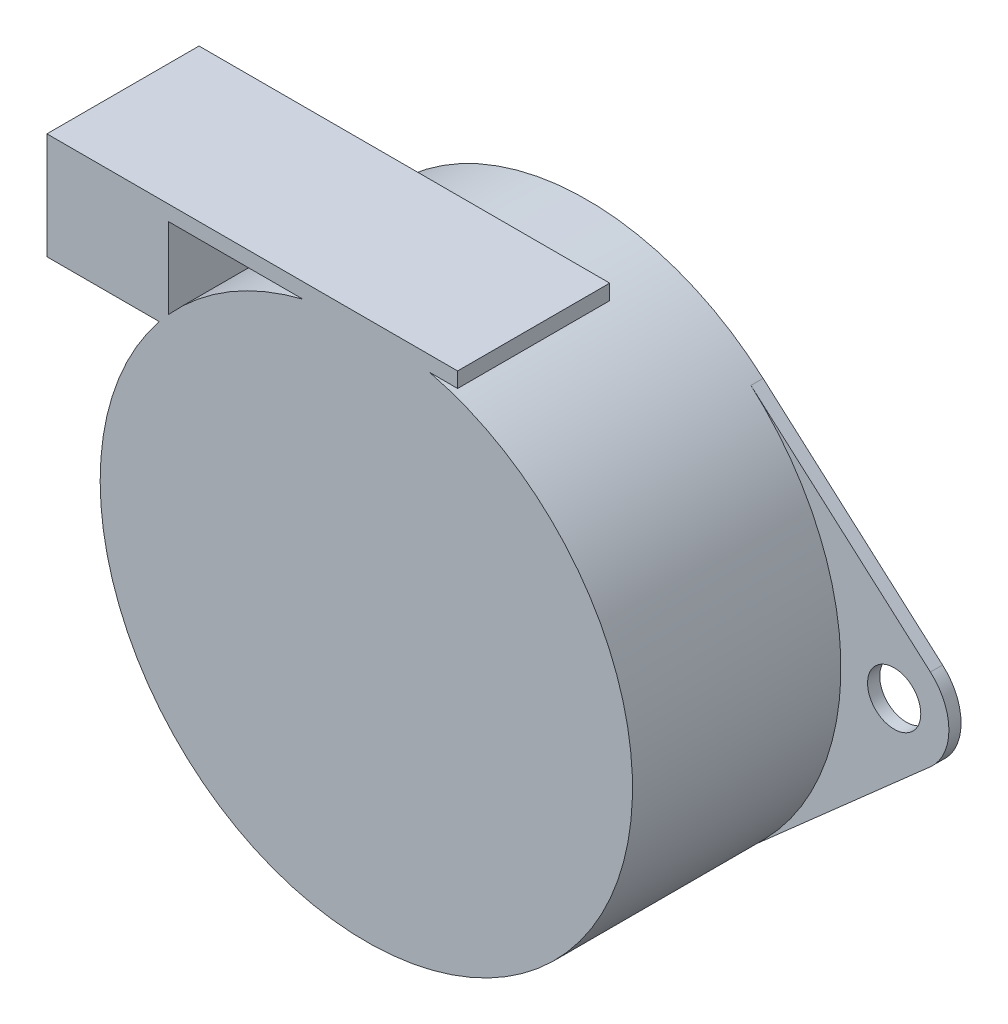
ISO-10303-21;
HEADER;
FILE_DESCRIPTION(('STEP AP214'),'2;1');
FILE_NAME('part.step','',(''),(''),'','','');
FILE_SCHEMA(('AUTOMOTIVE_DESIGN { 1 0 10303 214 1 1 1 1 }'));
ENDSEC;
DATA;
#1=APPLICATION_CONTEXT('core data for automotive mechanical design processes');
#2=APPLICATION_PROTOCOL_DEFINITION('international standard','automotive_design',2000,#1);
#3=PRODUCT_CONTEXT('',#1,'mechanical');
#4=PRODUCT('Part','Part','',(#3));
#5=PRODUCT_RELATED_PRODUCT_CATEGORY('part','',(#4));
#6=PRODUCT_DEFINITION_FORMATION('','',#4);
#7=PRODUCT_DEFINITION_CONTEXT('part definition',#1,'design');
#8=PRODUCT_DEFINITION('design','',#6,#7);
#9=PRODUCT_DEFINITION_SHAPE('','',#8);
#10=(LENGTH_UNIT() NAMED_UNIT(*) SI_UNIT(.MILLI.,.METRE.));
#11=(NAMED_UNIT(*) PLANE_ANGLE_UNIT() SI_UNIT($,.RADIAN.));
#12=(NAMED_UNIT(*) SI_UNIT($,.STERADIAN.) SOLID_ANGLE_UNIT());
#13=UNCERTAINTY_MEASURE_WITH_UNIT(LENGTH_MEASURE(1.E-05),#10,'distance_accuracy_value','');
#14=(GEOMETRIC_REPRESENTATION_CONTEXT(3) GLOBAL_UNCERTAINTY_ASSIGNED_CONTEXT((#13)) GLOBAL_UNIT_ASSIGNED_CONTEXT((#10,
#11,#12)) REPRESENTATION_CONTEXT('',''));
#15=CARTESIAN_POINT('',(0.,0.,0.));
#16=DIRECTION('',(0.,0.,1.));
#17=DIRECTION('',(1.,0.,0.));
#18=AXIS2_PLACEMENT_3D('',#15,#16,#17);
#19=CARTESIAN_POINT('',(0.,0.,0.8));
#20=DIRECTION('',(0.,0.,-1.));
#21=DIRECTION('',(-1.,0.,0.));
#22=AXIS2_PLACEMENT_3D('',#19,#20,#21);
#23=CYLINDRICAL_SURFACE('',#22,17.4999999999699);
#24=CARTESIAN_POINT('',(0.,0.,0.));
#25=DIRECTION('',(0.,0.,1.));
#26=DIRECTION('',(1.,0.,0.));
#27=AXIS2_PLACEMENT_3D('',#24,#25,#26);
#28=CIRCLE('',#27,17.4999999999699);
#29=CARTESIAN_POINT('',(-11.5833333333093,-13.1177890243894,0.));
#30=VERTEX_POINT('',#29);
#31=CARTESIAN_POINT('',(11.5833333333093,-13.1177890243894,0.));
#32=VERTEX_POINT('',#31);
#33=EDGE_CURVE('E268',#30,#32,#28,.T.);
#34=ORIENTED_EDGE('',*,*,#33,.T.);
#35=DIRECTION('',(0.,0.,-1.));
#36=VECTOR('',#35,1.);
#37=CARTESIAN_POINT('',(11.5833333333093,-13.1177890243894,0.8));
#38=LINE('',#37,#36);
#39=CARTESIAN_POINT('',(11.5833333333093,-13.1177890243894,0.8));
#40=VERTEX_POINT('',#39);
#41=EDGE_CURVE('E280',#40,#32,#38,.T.);
#42=ORIENTED_EDGE('',*,*,#41,.F.);
#43=CARTESIAN_POINT('',(0.,0.,0.8));
#44=DIRECTION('',(0.,0.,1.));
#45=DIRECTION('',(1.,0.,0.));
#46=AXIS2_PLACEMENT_3D('',#43,#44,#45);
#47=CIRCLE('',#46,17.4999999999983);
#48=CARTESIAN_POINT('',(11.5833333333336,13.1177890244058,0.8));
#49=VERTEX_POINT('',#48);
#50=EDGE_CURVE('E291',#40,#49,#47,.T.);
#51=ORIENTED_EDGE('',*,*,#50,.T.);
#52=DIRECTION('',(0.,0.,-1.));
#53=VECTOR('',#52,1.);
#54=CARTESIAN_POINT('',(11.5833333333281,13.1177890244107,0.8));
#55=LINE('',#54,#53);
#56=CARTESIAN_POINT('',(11.5833333333281,13.1177890244107,0.));
#57=VERTEX_POINT('',#56);
#58=EDGE_CURVE('E292',#49,#57,#55,.T.);
#59=ORIENTED_EDGE('',*,*,#58,.T.);
#60=CARTESIAN_POINT('',(0.,0.,0.));
#61=DIRECTION('',(0.,0.,1.));
#62=DIRECTION('',(1.,0.,0.));
#63=AXIS2_PLACEMENT_3D('',#60,#61,#62);
#64=CIRCLE('',#63,17.4999999999983);
#65=CARTESIAN_POINT('',(-11.5833333333281,13.1177890244107,0.));
#66=VERTEX_POINT('',#65);
#67=EDGE_CURVE('E259',#66,#57,#64,.F.);
#68=ORIENTED_EDGE('',*,*,#67,.F.);
#69=DIRECTION('',(0.,0.,-1.));
#70=VECTOR('',#69,1.);
#71=CARTESIAN_POINT('',(-11.5833333333281,13.1177890244107,0.8));
#72=LINE('',#71,#70);
#73=CARTESIAN_POINT('',(-11.5833333333281,13.1177890244107,0.8));
#74=VERTEX_POINT('',#73);
#75=EDGE_CURVE('E288',#74,#66,#72,.T.);
#76=ORIENTED_EDGE('',*,*,#75,.F.);
#77=CARTESIAN_POINT('',(-11.5833333333093,-13.1177890243894,0.8));
#78=VERTEX_POINT('',#77);
#79=EDGE_CURVE('E298',#74,#78,#47,.T.);
#80=ORIENTED_EDGE('',*,*,#79,.T.);
#81=DIRECTION('',(0.,0.,-1.));
#82=VECTOR('',#81,1.);
#83=CARTESIAN_POINT('',(-11.5833333333093,-13.1177890243894,0.8));
#84=LINE('',#83,#82);
#85=EDGE_CURVE('E285',#78,#30,#84,.T.);
#86=ORIENTED_EDGE('',*,*,#85,.T.);
#87=EDGE_LOOP('',(#34,#42,#51,#59,#68,#76,#80,#86));
#88=FACE_BOUND('',#87,.T.);
#89=DIRECTION('',(0.,0.,-1.));
#90=VECTOR('',#89,1.);
#91=CARTESIAN_POINT('',(4.1533119313391,16.9999999999983,0.8));
#92=LINE('',#91,#90);
#93=CARTESIAN_POINT('',(4.15331193145884,16.9999999999983,14.5));
#94=VERTEX_POINT('',#93);
#95=CARTESIAN_POINT('',(4.1533119313391,16.9999999999983,4.50000000000364));
#96=VERTEX_POINT('',#95);
#97=EDGE_CURVE('E201',#94,#96,#92,.T.);
#98=ORIENTED_EDGE('',*,*,#97,.F.);
#99=CARTESIAN_POINT('',(0.,0.,14.5));
#100=DIRECTION('',(0.,0.,1.));
#101=DIRECTION('',(1.,0.,0.));
#102=AXIS2_PLACEMENT_3D('',#99,#100,#101);
#103=CIRCLE('',#102,17.4999999999983);
#104=CARTESIAN_POINT('',(-13.6106575888154,10.9999999999983,14.4999999999991));
#105=VERTEX_POINT('',#104);
#106=EDGE_CURVE('E234',#105,#94,#103,.T.);
#107=ORIENTED_EDGE('',*,*,#106,.F.);
#108=DIRECTION('',(0.,0.,-1.));
#109=VECTOR('',#108,1.);
#110=CARTESIAN_POINT('',(-13.6106575887788,10.9999999999983,0.8));
#111=LINE('',#110,#109);
#112=CARTESIAN_POINT('',(-13.6106575887788,10.9999999999983,4.50000000000364));
#113=VERTEX_POINT('',#112);
#114=EDGE_CURVE('E218',#113,#105,#111,.F.);
#115=ORIENTED_EDGE('',*,*,#114,.F.);
#116=CARTESIAN_POINT('',(0.,0.,4.50000000000364));
#117=DIRECTION('',(0.,0.,1.));
#118=DIRECTION('',(1.,0.,0.));
#119=AXIS2_PLACEMENT_3D('',#116,#117,#118);
#120=CIRCLE('',#119,17.4999999999699);
#121=CARTESIAN_POINT('',(-12.9999999999933,11.7153745138224,4.50000000000364));
#122=VERTEX_POINT('',#121);
#123=EDGE_CURVE('E11',#122,#113,#120,.T.);
#124=ORIENTED_EDGE('',*,*,#123,.F.);
#125=DIRECTION('',(0.,0.,-1.));
#126=VECTOR('',#125,1.);
#127=CARTESIAN_POINT('',(-12.9999999999933,11.7153745138224,0.8));
#128=LINE('',#127,#126);
#129=CARTESIAN_POINT('',(-12.9999999999933,11.7153745138649,14.5));
#130=VERTEX_POINT('',#129);
#131=EDGE_CURVE('E221',#130,#122,#128,.T.);
#132=ORIENTED_EDGE('',*,*,#131,.F.);
#133=CARTESIAN_POINT('',(-4.15331193145884,16.9999999999983,14.4999999999991));
#134=VERTEX_POINT('',#133);
#135=EDGE_CURVE('E233',#134,#130,#103,.T.);
#136=ORIENTED_EDGE('',*,*,#135,.F.);
#137=DIRECTION('',(0.,0.,-1.));
#138=VECTOR('',#137,1.);
#139=CARTESIAN_POINT('',(-4.1533119313391,16.9999999999983,0.8));
#140=LINE('',#139,#138);
#141=CARTESIAN_POINT('',(-4.1533119313391,16.9999999999983,4.50000000000364));
#142=VERTEX_POINT('',#141);
#143=EDGE_CURVE('E56',#142,#134,#140,.F.);
#144=ORIENTED_EDGE('',*,*,#143,.F.);
#145=CARTESIAN_POINT('',(0.,0.,4.50000000000364));
#146=DIRECTION('',(0.,0.,-1.));
#147=DIRECTION('',(-1.,0.,0.));
#148=AXIS2_PLACEMENT_3D('',#145,#146,#147);
#149=CIRCLE('',#148,17.4999999999699);
#150=EDGE_CURVE('E51',#142,#96,#149,.T.);
#151=ORIENTED_EDGE('',*,*,#150,.T.);
#152=EDGE_LOOP('',(#98,#107,#115,#124,#132,#136,#144,#151));
#153=FACE_BOUND('',#152,.T.);
#154=ADVANCED_FACE('F36',(#88,#153),#23,.T.);
#155=CARTESIAN_POINT('',(0.,0.,0.8));
#156=DIRECTION('',(0.,0.,1.));
#157=DIRECTION('',(1.,0.,0.));
#158=AXIS2_PLACEMENT_3D('',#155,#156,#157);
#159=PLANE('',#158);
#160=ORIENTED_EDGE('',*,*,#79,.F.);
#161=DIRECTION('',(-0.749587944251835,-0.661904761904844,0.));
#162=VECTOR('',#161,1.);
#163=CARTESIAN_POINT('',(-11.5833333333336,13.1177890244058,0.8));
#164=LINE('',#163,#162);
#165=CARTESIAN_POINT('',(-23.3828571428582,2.69851659930132,0.8));
#166=VERTEX_POINT('',#165);
#167=EDGE_CURVE('E245',#74,#166,#164,.T.);
#168=ORIENTED_EDGE('',*,*,#167,.T.);
#169=CARTESIAN_POINT('',(-21.0000000000075,0.,0.8));
#170=DIRECTION('',(0.,0.,1.));
#171=DIRECTION('',(1.,0.,0.));
#172=AXIS2_PLACEMENT_3D('',#169,#170,#171);
#173=CIRCLE('',#172,3.5999999999774);
#174=CARTESIAN_POINT('',(-23.3828571428394,-2.69851659928003,0.8));
#175=VERTEX_POINT('',#174);
#176=EDGE_CURVE('E242',#166,#175,#173,.T.);
#177=ORIENTED_EDGE('',*,*,#176,.T.);
#178=DIRECTION('',(0.749587944251835,-0.661904761904844,0.));
#179=VECTOR('',#178,1.);
#180=CARTESIAN_POINT('',(-11.5833333333148,-13.1177890243845,0.8));
#181=LINE('',#180,#179);
#182=EDGE_CURVE('E244',#175,#78,#181,.T.);
#183=ORIENTED_EDGE('',*,*,#182,.T.);
#184=EDGE_LOOP('',(#160,#168,#177,#183));
#185=FACE_BOUND('',#184,.T.);
#186=CARTESIAN_POINT('',(-21.0000000000075,0.,0.8));
#187=DIRECTION('',(0.,0.,1.));
#188=DIRECTION('',(1.,0.,0.));
#189=AXIS2_PLACEMENT_3D('',#186,#187,#188);
#190=CIRCLE('',#189,1.75);
#191=CARTESIAN_POINT('',(-19.2500000000075,0.,0.8));
#192=VERTEX_POINT('',#191);
#193=EDGE_CURVE('E246',#192,#192,#190,.T.);
#194=ORIENTED_EDGE('',*,*,#193,.F.);
#195=EDGE_LOOP('',(#194));
#196=FACE_BOUND('',#195,.T.);
#197=ADVANCED_FACE('F338',(#185,#196),#159,.T.);
#198=CARTESIAN_POINT('',(21.0000000000075,0.,0.8));
#199=DIRECTION('',(0.,0.,-1.));
#200=DIRECTION('',(-1.,0.,0.));
#201=AXIS2_PLACEMENT_3D('',#198,#199,#200);
#202=CYLINDRICAL_SURFACE('',#201,3.5999999999774);
#203=CARTESIAN_POINT('',(21.0000000000075,0.,0.));
#204=DIRECTION('',(0.,0.,1.));
#205=DIRECTION('',(1.,0.,0.));
#206=AXIS2_PLACEMENT_3D('',#203,#204,#205);
#207=CIRCLE('',#206,3.5999999999774);
#208=CARTESIAN_POINT('',(23.3828571428582,2.69851659930132,0.));
#209=VERTEX_POINT('',#208);
#210=CARTESIAN_POINT('',(23.3828571428394,-2.69851659928003,0.));
#211=VERTEX_POINT('',#210);
#212=EDGE_CURVE('E236',#209,#211,#207,.F.);
#213=ORIENTED_EDGE('',*,*,#212,.F.);
#214=DIRECTION('',(0.,0.,-1.));
#215=VECTOR('',#214,1.);
#216=CARTESIAN_POINT('',(23.3828571428582,2.69851659930132,0.8));
#217=LINE('',#216,#215);
#218=CARTESIAN_POINT('',(23.3828571428582,2.69851659930132,0.8));
#219=VERTEX_POINT('',#218);
#220=EDGE_CURVE('E289',#219,#209,#217,.T.);
#221=ORIENTED_EDGE('',*,*,#220,.F.);
#222=CARTESIAN_POINT('',(21.0000000000075,0.,0.8));
#223=DIRECTION('',(0.,0.,1.));
#224=DIRECTION('',(1.,0.,0.));
#225=AXIS2_PLACEMENT_3D('',#222,#223,#224);
#226=CIRCLE('',#225,3.5999999999774);
#227=CARTESIAN_POINT('',(23.3828571428394,-2.69851659928003,0.8));
#228=VERTEX_POINT('',#227);
#229=EDGE_CURVE('E237',#219,#228,#226,.F.);
#230=ORIENTED_EDGE('',*,*,#229,.T.);
#231=DIRECTION('',(0.,0.,-1.));
#232=VECTOR('',#231,1.);
#233=CARTESIAN_POINT('',(23.3828571428394,-2.69851659928003,0.8));
#234=LINE('',#233,#232);
#235=EDGE_CURVE('E253',#228,#211,#234,.T.);
#236=ORIENTED_EDGE('',*,*,#235,.T.);
#237=EDGE_LOOP('',(#213,#221,#230,#236));
#238=FACE_BOUND('',#237,.T.);
#239=ADVANCED_FACE('F38',(#238),#202,.T.);
#240=CARTESIAN_POINT('',(11.5833333333336,13.1177890244058,0.8));
#241=DIRECTION('',(0.661904761904844,0.749587944251835,0.));
#242=DIRECTION('',(-0.749587944251835,0.661904761904844,0.));
#243=AXIS2_PLACEMENT_3D('',#240,#241,#242);
#244=PLANE('',#243);
#245=DIRECTION('',(0.749587944251835,-0.661904761904844,0.));
#246=VECTOR('',#245,1.);
#247=CARTESIAN_POINT('',(11.5833333333336,13.1177890244058,0.));
#248=LINE('',#247,#246);
#249=EDGE_CURVE('E256',#57,#209,#248,.T.);
#250=ORIENTED_EDGE('',*,*,#249,.F.);
#251=ORIENTED_EDGE('',*,*,#58,.F.);
#252=DIRECTION('',(0.749587944251835,-0.661904761904844,0.));
#253=VECTOR('',#252,1.);
#254=CARTESIAN_POINT('',(11.5833333333336,13.1177890244058,0.8));
#255=LINE('',#254,#253);
#256=EDGE_CURVE('E240',#49,#219,#255,.T.);
#257=ORIENTED_EDGE('',*,*,#256,.T.);
#258=ORIENTED_EDGE('',*,*,#220,.T.);
#259=EDGE_LOOP('',(#250,#251,#257,#258));
#260=FACE_BOUND('',#259,.T.);
#261=ADVANCED_FACE('F368',(#260),#244,.T.);
#262=CARTESIAN_POINT('',(-11.5833333333336,13.1177890244058,0.8));
#263=DIRECTION('',(0.661904761904844,-0.749587944251835,0.));
#264=DIRECTION('',(0.749587944251835,0.661904761904844,0.));
#265=AXIS2_PLACEMENT_3D('',#262,#263,#264);
#266=PLANE('',#265);
#267=DIRECTION('',(-0.749587944251835,-0.661904761904844,0.));
#268=VECTOR('',#267,1.);
#269=CARTESIAN_POINT('',(-11.5833333333336,13.1177890244058,0.));
#270=LINE('',#269,#268);
#271=CARTESIAN_POINT('',(-23.3828571428582,2.69851659930132,0.));
#272=VERTEX_POINT('',#271);
#273=EDGE_CURVE('E262',#66,#272,#270,.T.);
#274=ORIENTED_EDGE('',*,*,#273,.T.);
#275=DIRECTION('',(0.,0.,-1.));
#276=VECTOR('',#275,1.);
#277=CARTESIAN_POINT('',(-23.3828571428582,2.69851659930132,0.8));
#278=LINE('',#277,#276);
#279=EDGE_CURVE('E284',#166,#272,#278,.T.);
#280=ORIENTED_EDGE('',*,*,#279,.F.);
#281=ORIENTED_EDGE('',*,*,#167,.F.);
#282=ORIENTED_EDGE('',*,*,#75,.T.);
#283=EDGE_LOOP('',(#274,#280,#281,#282));
#284=FACE_BOUND('',#283,.T.);
#285=ADVANCED_FACE('F344',(#284),#266,.F.);
#286=CARTESIAN_POINT('',(-21.0000000000075,0.,0.8));
#287=DIRECTION('',(0.,0.,-1.));
#288=DIRECTION('',(-1.,0.,0.));
#289=AXIS2_PLACEMENT_3D('',#286,#287,#288);
#290=CYLINDRICAL_SURFACE('',#289,3.5999999999774);
#291=CARTESIAN_POINT('',(-21.0000000000075,0.,0.));
#292=DIRECTION('',(0.,0.,1.));
#293=DIRECTION('',(1.,0.,0.));
#294=AXIS2_PLACEMENT_3D('',#291,#292,#293);
#295=CIRCLE('',#294,3.5999999999774);
#296=CARTESIAN_POINT('',(-23.3828571428394,-2.69851659928003,0.));
#297=VERTEX_POINT('',#296);
#298=EDGE_CURVE('E264',#272,#297,#295,.T.);
#299=ORIENTED_EDGE('',*,*,#298,.T.);
#300=DIRECTION('',(0.,0.,-1.));
#301=VECTOR('',#300,1.);
#302=CARTESIAN_POINT('',(-23.3828571428394,-2.69851659928003,0.8));
#303=LINE('',#302,#301);
#304=EDGE_CURVE('E281',#175,#297,#303,.T.);
#305=ORIENTED_EDGE('',*,*,#304,.F.);
#306=ORIENTED_EDGE('',*,*,#176,.F.);
#307=ORIENTED_EDGE('',*,*,#279,.T.);
#308=EDGE_LOOP('',(#299,#305,#306,#307));
#309=FACE_BOUND('',#308,.T.);
#310=ADVANCED_FACE('F348',(#309),#290,.T.);
#311=CARTESIAN_POINT('',(-11.5833333333148,-13.1177890243845,0.8));
#312=DIRECTION('',(0.661904761904844,0.749587944251835,0.));
#313=DIRECTION('',(-0.749587944251835,0.661904761904844,0.));
#314=AXIS2_PLACEMENT_3D('',#311,#312,#313);
#315=PLANE('',#314);
#316=DIRECTION('',(0.749587944251835,-0.661904761904844,0.));
#317=VECTOR('',#316,1.);
#318=CARTESIAN_POINT('',(-11.5833333333148,-13.1177890243845,0.));
#319=LINE('',#318,#317);
#320=EDGE_CURVE('E266',#297,#30,#319,.T.);
#321=ORIENTED_EDGE('',*,*,#320,.T.);
#322=ORIENTED_EDGE('',*,*,#85,.F.);
#323=ORIENTED_EDGE('',*,*,#182,.F.);
#324=ORIENTED_EDGE('',*,*,#304,.T.);
#325=EDGE_LOOP('',(#321,#322,#323,#324));
#326=FACE_BOUND('',#325,.T.);
#327=ADVANCED_FACE('F351',(#326),#315,.F.);
#328=CARTESIAN_POINT('',(-21.0000000000075,0.,0.8));
#329=DIRECTION('',(0.,0.,-1.));
#330=DIRECTION('',(-1.,0.,0.));
#331=AXIS2_PLACEMENT_3D('',#328,#329,#330);
#332=CYLINDRICAL_SURFACE('',#331,1.75);
#333=ORIENTED_EDGE('',*,*,#193,.T.);
#334=EDGE_LOOP('',(#333));
#335=FACE_BOUND('',#334,.T.);
#336=CARTESIAN_POINT('',(-21.0000000000075,0.,0.));
#337=DIRECTION('',(0.,0.,1.));
#338=DIRECTION('',(1.,0.,0.));
#339=AXIS2_PLACEMENT_3D('',#336,#337,#338);
#340=CIRCLE('',#339,1.75);
#341=CARTESIAN_POINT('',(-19.2500000000075,0.,0.));
#342=VERTEX_POINT('',#341);
#343=EDGE_CURVE('E274',#342,#342,#340,.T.);
#344=ORIENTED_EDGE('',*,*,#343,.F.);
#345=EDGE_LOOP('',(#344));
#346=FACE_BOUND('',#345,.T.);
#347=ADVANCED_FACE('F387',(#335,#346),#332,.F.);
#348=CARTESIAN_POINT('',(11.5833333333148,-13.1177890243845,0.8));
#349=DIRECTION('',(0.661904761904844,-0.749587944251835,0.));
#350=DIRECTION('',(0.749587944251835,0.661904761904844,0.));
#351=AXIS2_PLACEMENT_3D('',#348,#349,#350);
#352=PLANE('',#351);
#353=DIRECTION('',(-0.749587944251835,-0.661904761904844,0.));
#354=VECTOR('',#353,1.);
#355=CARTESIAN_POINT('',(11.5833333333148,-13.1177890243845,0.));
#356=LINE('',#355,#354);
#357=EDGE_CURVE('E271',#211,#32,#356,.T.);
#358=ORIENTED_EDGE('',*,*,#357,.F.);
#359=ORIENTED_EDGE('',*,*,#235,.F.);
#360=DIRECTION('',(-0.749587944251835,-0.661904761904844,0.));
#361=VECTOR('',#360,1.);
#362=CARTESIAN_POINT('',(11.5833333333148,-13.1177890243845,0.8));
#363=LINE('',#362,#361);
#364=EDGE_CURVE('E250',#228,#40,#363,.T.);
#365=ORIENTED_EDGE('',*,*,#364,.T.);
#366=ORIENTED_EDGE('',*,*,#41,.T.);
#367=EDGE_LOOP('',(#358,#359,#365,#366));
#368=FACE_BOUND('',#367,.T.);
#369=ADVANCED_FACE('F357',(#368),#352,.T.);
#370=CARTESIAN_POINT('',(21.0000000000075,0.,0.8));
#371=DIRECTION('',(0.,0.,-1.));
#372=DIRECTION('',(-1.,0.,0.));
#373=AXIS2_PLACEMENT_3D('',#370,#371,#372);
#374=CYLINDRICAL_SURFACE('',#373,1.75);
#375=CARTESIAN_POINT('',(21.0000000000075,0.,0.8));
#376=DIRECTION('',(0.,0.,1.));
#377=DIRECTION('',(1.,0.,0.));
#378=AXIS2_PLACEMENT_3D('',#375,#376,#377);
#379=CIRCLE('',#378,1.75);
#380=CARTESIAN_POINT('',(22.7500000000075,0.,0.8));
#381=VERTEX_POINT('',#380);
#382=EDGE_CURVE('E249',#381,#381,#379,.F.);
#383=ORIENTED_EDGE('',*,*,#382,.F.);
#384=EDGE_LOOP('',(#383));
#385=FACE_BOUND('',#384,.T.);
#386=CARTESIAN_POINT('',(21.0000000000075,0.,0.));
#387=DIRECTION('',(0.,0.,1.));
#388=DIRECTION('',(1.,0.,0.));
#389=AXIS2_PLACEMENT_3D('',#386,#387,#388);
#390=CIRCLE('',#389,1.75);
#391=CARTESIAN_POINT('',(22.7500000000075,0.,0.));
#392=VERTEX_POINT('',#391);
#393=EDGE_CURVE('E241',#392,#392,#390,.F.);
#394=ORIENTED_EDGE('',*,*,#393,.T.);
#395=EDGE_LOOP('',(#394));
#396=FACE_BOUND('',#395,.T.);
#397=ADVANCED_FACE('F411',(#385,#396),#374,.F.);
#398=ORIENTED_EDGE('',*,*,#50,.F.);
#399=ORIENTED_EDGE('',*,*,#364,.F.);
#400=ORIENTED_EDGE('',*,*,#229,.F.);
#401=ORIENTED_EDGE('',*,*,#256,.F.);
#402=EDGE_LOOP('',(#398,#399,#400,#401));
#403=FACE_BOUND('',#402,.T.);
#404=ORIENTED_EDGE('',*,*,#382,.T.);
#405=EDGE_LOOP('',(#404));
#406=FACE_BOUND('',#405,.T.);
#407=ADVANCED_FACE('F363',(#403,#406),#159,.T.);
#408=CARTESIAN_POINT('',(0.,0.,0.));
#409=DIRECTION('',(0.,0.,1.));
#410=DIRECTION('',(1.,0.,0.));
#411=AXIS2_PLACEMENT_3D('',#408,#409,#410);
#412=PLANE('',#411);
#413=CARTESIAN_POINT('',(0.,0.,0.));
#414=DIRECTION('',(0.,0.,1.));
#415=DIRECTION('',(1.,0.,0.));
#416=AXIS2_PLACEMENT_3D('',#413,#414,#415);
#417=CIRCLE('',#416,5.);
#418=CARTESIAN_POINT('',(5.,0.,0.));
#419=VERTEX_POINT('',#418);
#420=EDGE_CURVE('E44',#419,#419,#417,.F.);
#421=ORIENTED_EDGE('',*,*,#420,.F.);
#422=EDGE_LOOP('',(#421));
#423=FACE_BOUND('',#422,.T.);
#424=ORIENTED_EDGE('',*,*,#212,.T.);
#425=ORIENTED_EDGE('',*,*,#357,.T.);
#426=ORIENTED_EDGE('',*,*,#33,.F.);
#427=ORIENTED_EDGE('',*,*,#320,.F.);
#428=ORIENTED_EDGE('',*,*,#298,.F.);
#429=ORIENTED_EDGE('',*,*,#273,.F.);
#430=ORIENTED_EDGE('',*,*,#67,.T.);
#431=ORIENTED_EDGE('',*,*,#249,.T.);
#432=EDGE_LOOP('',(#424,#425,#426,#427,#428,#429,#430,#431));
#433=FACE_BOUND('',#432,.T.);
#434=ORIENTED_EDGE('',*,*,#343,.T.);
#435=EDGE_LOOP('',(#434));
#436=FACE_BOUND('',#435,.T.);
#437=ORIENTED_EDGE('',*,*,#393,.F.);
#438=EDGE_LOOP('',(#437));
#439=FACE_BOUND('',#438,.T.);
#440=ADVANCED_FACE('F353',(#423,#433,#436,#439),#412,.F.);
#441=CARTESIAN_POINT('',(0.,0.,14.5));
#442=DIRECTION('',(0.,0.,1.));
#443=DIRECTION('',(1.,0.,0.));
#444=AXIS2_PLACEMENT_3D('',#441,#442,#443);
#445=PLANE('',#444);
#446=DIRECTION('',(1.,0.,0.));
#447=VECTOR('',#446,1.);
#448=CARTESIAN_POINT('',(-20.9999999999933,16.9999999999983,14.4999999999991));
#449=LINE('',#448,#447);
#450=CARTESIAN_POINT('',(-12.9999999999933,16.9999999999983,14.4999999999991));
#451=VERTEX_POINT('',#450);
#452=EDGE_CURVE('E188',#451,#134,#449,.T.);
#453=ORIENTED_EDGE('',*,*,#452,.T.);
#454=ORIENTED_EDGE('',*,*,#135,.T.);
#455=DIRECTION('',(0.,1.,0.));
#456=VECTOR('',#455,1.);
#457=CARTESIAN_POINT('',(-12.9999999999933,10.9999999999983,14.4999999999991));
#458=LINE('',#457,#456);
#459=EDGE_CURVE('E164',#130,#451,#458,.T.);
#460=ORIENTED_EDGE('',*,*,#459,.T.);
#461=EDGE_LOOP('',(#453,#454,#460));
#462=FACE_BOUND('',#461,.T.);
#463=ORIENTED_EDGE('',*,*,#106,.T.);
#464=CARTESIAN_POINT('',(6.00000000000012,16.9999999999983,14.4999999999991));
#465=VERTEX_POINT('',#464);
#466=EDGE_CURVE('E186',#94,#465,#449,.T.);
#467=ORIENTED_EDGE('',*,*,#466,.T.);
#468=DIRECTION('',(0.,1.,0.));
#469=VECTOR('',#468,1.);
#470=CARTESIAN_POINT('',(6.00000000000012,16.9999999999983,14.4999999999991));
#471=LINE('',#470,#469);
#472=CARTESIAN_POINT('',(6.00000000000012,17.9999999999983,14.4999999999991));
#473=VERTEX_POINT('',#472);
#474=EDGE_CURVE('E172',#465,#473,#471,.T.);
#475=ORIENTED_EDGE('',*,*,#474,.T.);
#476=DIRECTION('',(1.,0.,0.));
#477=VECTOR('',#476,1.);
#478=CARTESIAN_POINT('',(-20.9999999999933,17.9999999999983,14.4999999999991));
#479=LINE('',#478,#477);
#480=CARTESIAN_POINT('',(-20.9999999999933,17.9999999999983,14.4999999999991));
#481=VERTEX_POINT('',#480);
#482=EDGE_CURVE('E168',#481,#473,#479,.T.);
#483=ORIENTED_EDGE('',*,*,#482,.F.);
#484=DIRECTION('',(0.,1.,0.));
#485=VECTOR('',#484,1.);
#486=CARTESIAN_POINT('',(-20.9999999999933,10.9999999999983,14.4999999999991));
#487=LINE('',#486,#485);
#488=CARTESIAN_POINT('',(-20.9999999999933,10.9999999999983,14.4999999999991));
#489=VERTEX_POINT('',#488);
#490=EDGE_CURVE('E154',#489,#481,#487,.T.);
#491=ORIENTED_EDGE('',*,*,#490,.F.);
#492=DIRECTION('',(-1.,0.,0.));
#493=VECTOR('',#492,1.);
#494=CARTESIAN_POINT('',(-20.9999999999933,10.9999999999983,14.4999999999991));
#495=LINE('',#494,#493);
#496=EDGE_CURVE('E165',#105,#489,#495,.T.);
#497=ORIENTED_EDGE('',*,*,#496,.F.);
#498=EDGE_LOOP('',(#463,#467,#475,#483,#491,#497));
#499=FACE_BOUND('',#498,.T.);
#500=ADVANCED_FACE('F170',(#462,#499),#445,.T.);
#501=CARTESIAN_POINT('',(0.,0.,-1.5));
#502=DIRECTION('',(0.,0.,1.));
#503=DIRECTION('',(1.,0.,0.));
#504=AXIS2_PLACEMENT_3D('',#501,#502,#503);
#505=CYLINDRICAL_SURFACE('',#504,5.);
#506=CARTESIAN_POINT('',(0.,0.,-1.5));
#507=DIRECTION('',(0.,0.,-1.));
#508=DIRECTION('',(-1.,0.,0.));
#509=AXIS2_PLACEMENT_3D('',#506,#507,#508);
#510=CIRCLE('',#509,5.);
#511=CARTESIAN_POINT('',(-5.,0.,-1.5));
#512=VERTEX_POINT('',#511);
#513=EDGE_CURVE('E228',#512,#512,#510,.T.);
#514=ORIENTED_EDGE('',*,*,#513,.F.);
#515=EDGE_LOOP('',(#514));
#516=FACE_BOUND('',#515,.T.);
#517=ORIENTED_EDGE('',*,*,#420,.T.);
#518=EDGE_LOOP('',(#517));
#519=FACE_BOUND('',#518,.T.);
#520=ADVANCED_FACE('F437',(#516,#519),#505,.T.);
#521=CARTESIAN_POINT('',(0.,0.,-1.5));
#522=DIRECTION('',(0.,0.,-1.));
#523=DIRECTION('',(-1.,0.,0.));
#524=AXIS2_PLACEMENT_3D('',#521,#522,#523);
#525=PLANE('',#524);
#526=CARTESIAN_POINT('',(0.,0.,-1.5));
#527=DIRECTION('',(0.,0.,-1.));
#528=DIRECTION('',(-1.,0.,0.));
#529=AXIS2_PLACEMENT_3D('',#526,#527,#528);
#530=CIRCLE('',#529,1.);
#531=CARTESIAN_POINT('',(-1.,0.,-1.5));
#532=VERTEX_POINT('',#531);
#533=EDGE_CURVE('E224',#532,#532,#530,.T.);
#534=ORIENTED_EDGE('',*,*,#533,.F.);
#535=EDGE_LOOP('',(#534));
#536=FACE_BOUND('',#535,.T.);
#537=ORIENTED_EDGE('',*,*,#513,.T.);
#538=EDGE_LOOP('',(#537));
#539=FACE_BOUND('',#538,.T.);
#540=ADVANCED_FACE('F445',(#536,#539),#525,.T.);
#541=CARTESIAN_POINT('',(0.,0.,-7.5));
#542=DIRECTION('',(0.,0.,1.));
#543=DIRECTION('',(1.,0.,0.));
#544=AXIS2_PLACEMENT_3D('',#541,#542,#543);
#545=CYLINDRICAL_SURFACE('',#544,1.);
#546=CARTESIAN_POINT('',(0.,0.,-7.5));
#547=DIRECTION('',(0.,0.,-1.));
#548=DIRECTION('',(-1.,0.,0.));
#549=AXIS2_PLACEMENT_3D('',#546,#547,#548);
#550=CIRCLE('',#549,1.);
#551=CARTESIAN_POINT('',(-1.,0.,-7.5));
#552=VERTEX_POINT('',#551);
#553=EDGE_CURVE('E225',#552,#552,#550,.T.);
#554=ORIENTED_EDGE('',*,*,#553,.F.);
#555=EDGE_LOOP('',(#554));
#556=FACE_BOUND('',#555,.T.);
#557=ORIENTED_EDGE('',*,*,#533,.T.);
#558=EDGE_LOOP('',(#557));
#559=FACE_BOUND('',#558,.T.);
#560=ADVANCED_FACE('F453',(#556,#559),#545,.T.);
#561=CARTESIAN_POINT('',(0.,0.,-7.5));
#562=DIRECTION('',(0.,0.,-1.));
#563=DIRECTION('',(-1.,0.,0.));
#564=AXIS2_PLACEMENT_3D('',#561,#562,#563);
#565=PLANE('',#564);
#566=ORIENTED_EDGE('',*,*,#553,.T.);
#567=EDGE_LOOP('',(#566));
#568=FACE_BOUND('',#567,.T.);
#569=ADVANCED_FACE('F461',(#568),#565,.T.);
#570=CARTESIAN_POINT('',(-12.9999999999933,10.9999999999983,4.50000000000364));
#571=DIRECTION('',(-1.,0.,0.));
#572=DIRECTION('',(0.,0.,1.));
#573=AXIS2_PLACEMENT_3D('',#570,#571,#572);
#574=PLANE('',#573);
#575=ORIENTED_EDGE('',*,*,#459,.F.);
#576=ORIENTED_EDGE('',*,*,#131,.T.);
#577=DIRECTION('',(0.,1.,0.));
#578=VECTOR('',#577,1.);
#579=CARTESIAN_POINT('',(-12.9999999999933,10.9999999999983,4.50000000000364));
#580=LINE('',#579,#578);
#581=CARTESIAN_POINT('',(-12.9999999999933,16.9999999999983,4.50000000000364));
#582=VERTEX_POINT('',#581);
#583=EDGE_CURVE('E213',#122,#582,#580,.T.);
#584=ORIENTED_EDGE('',*,*,#583,.T.);
#585=DIRECTION('',(0.,0.,1.));
#586=VECTOR('',#585,1.);
#587=CARTESIAN_POINT('',(-12.9999999999933,16.9999999999983,4.50000000000364));
#588=LINE('',#587,#586);
#589=EDGE_CURVE('E203',#582,#451,#588,.T.);
#590=ORIENTED_EDGE('',*,*,#589,.T.);
#591=EDGE_LOOP('',(#575,#576,#584,#590));
#592=FACE_BOUND('',#591,.T.);
#593=ADVANCED_FACE('F469',(#592),#574,.F.);
#594=CARTESIAN_POINT('',(0.,10.9999999999983,0.));
#595=DIRECTION('',(0.,1.,0.));
#596=DIRECTION('',(0.,0.,1.));
#597=AXIS2_PLACEMENT_3D('',#594,#595,#596);
#598=PLANE('',#597);
#599=DIRECTION('',(1.,0.,0.));
#600=VECTOR('',#599,1.);
#601=CARTESIAN_POINT('',(-20.9999999999933,10.9999999999983,4.50000000000364));
#602=LINE('',#601,#600);
#603=CARTESIAN_POINT('',(-20.9999999999933,10.9999999999983,4.50000000000364));
#604=VERTEX_POINT('',#603);
#605=EDGE_CURVE('E205',#604,#113,#602,.T.);
#606=ORIENTED_EDGE('',*,*,#605,.T.);
#607=ORIENTED_EDGE('',*,*,#114,.T.);
#608=ORIENTED_EDGE('',*,*,#496,.T.);
#609=DIRECTION('',(0.,0.,-1.));
#610=VECTOR('',#609,1.);
#611=CARTESIAN_POINT('',(-20.9999999999933,10.9999999999983,4.50000000000364));
#612=LINE('',#611,#610);
#613=EDGE_CURVE('E161',#489,#604,#612,.T.);
#614=ORIENTED_EDGE('',*,*,#613,.T.);
#615=EDGE_LOOP('',(#606,#607,#608,#614));
#616=FACE_BOUND('',#615,.T.);
#617=ADVANCED_FACE('F476',(#616),#598,.F.);
#618=CARTESIAN_POINT('',(-20.9999999999933,10.9999999999983,4.50000000000364));
#619=DIRECTION('',(1.,0.,0.));
#620=DIRECTION('',(0.,0.,-1.));
#621=AXIS2_PLACEMENT_3D('',#618,#619,#620);
#622=PLANE('',#621);
#623=ORIENTED_EDGE('',*,*,#490,.T.);
#624=DIRECTION('',(0.,0.,1.));
#625=VECTOR('',#624,1.);
#626=CARTESIAN_POINT('',(-20.9999999999933,17.9999999999983,4.50000000000364));
#627=LINE('',#626,#625);
#628=CARTESIAN_POINT('',(-20.9999999999933,17.9999999999983,4.50000000000364));
#629=VERTEX_POINT('',#628);
#630=EDGE_CURVE('E159',#629,#481,#627,.T.);
#631=ORIENTED_EDGE('',*,*,#630,.F.);
#632=DIRECTION('',(0.,1.,0.));
#633=VECTOR('',#632,1.);
#634=CARTESIAN_POINT('',(-20.9999999999933,10.9999999999983,4.50000000000364));
#635=LINE('',#634,#633);
#636=EDGE_CURVE('E216',#604,#629,#635,.T.);
#637=ORIENTED_EDGE('',*,*,#636,.F.);
#638=ORIENTED_EDGE('',*,*,#613,.F.);
#639=EDGE_LOOP('',(#623,#631,#637,#638));
#640=FACE_BOUND('',#639,.T.);
#641=ADVANCED_FACE('F156',(#640),#622,.F.);
#642=CARTESIAN_POINT('',(-20.9999999999933,10.9999999999983,4.50000000000364));
#643=DIRECTION('',(0.,0.,1.));
#644=DIRECTION('',(1.,0.,0.));
#645=AXIS2_PLACEMENT_3D('',#642,#643,#644);
#646=PLANE('',#645);
#647=ORIENTED_EDGE('',*,*,#583,.F.);
#648=ORIENTED_EDGE('',*,*,#123,.T.);
#649=ORIENTED_EDGE('',*,*,#605,.F.);
#650=ORIENTED_EDGE('',*,*,#636,.T.);
#651=DIRECTION('',(-1.,0.,0.));
#652=VECTOR('',#651,1.);
#653=CARTESIAN_POINT('',(-20.9999999999933,17.9999999999983,4.50000000000364));
#654=LINE('',#653,#652);
#655=CARTESIAN_POINT('',(6.00000000000012,17.9999999999983,4.50000000000364));
#656=VERTEX_POINT('',#655);
#657=EDGE_CURVE('E181',#656,#629,#654,.T.);
#658=ORIENTED_EDGE('',*,*,#657,.F.);
#659=DIRECTION('',(0.,1.,0.));
#660=VECTOR('',#659,1.);
#661=CARTESIAN_POINT('',(6.00000000000012,16.9999999999983,4.50000000000364));
#662=LINE('',#661,#660);
#663=CARTESIAN_POINT('',(6.00000000000012,16.9999999999983,4.50000000000364));
#664=VERTEX_POINT('',#663);
#665=EDGE_CURVE('E196',#664,#656,#662,.T.);
#666=ORIENTED_EDGE('',*,*,#665,.F.);
#667=DIRECTION('',(-1.,0.,0.));
#668=VECTOR('',#667,1.);
#669=CARTESIAN_POINT('',(-20.9999999999933,16.9999999999983,4.50000000000364));
#670=LINE('',#669,#668);
#671=EDGE_CURVE('E193',#664,#96,#670,.T.);
#672=ORIENTED_EDGE('',*,*,#671,.T.);
#673=ORIENTED_EDGE('',*,*,#150,.F.);
#674=EDGE_CURVE('E192',#142,#582,#670,.T.);
#675=ORIENTED_EDGE('',*,*,#674,.T.);
#676=EDGE_LOOP('',(#647,#648,#649,#650,#658,#666,#672,#673,#675));
#677=FACE_BOUND('',#676,.T.);
#678=ADVANCED_FACE('F491',(#677),#646,.F.);
#679=CARTESIAN_POINT('',(0.,16.9999999999983,0.));
#680=DIRECTION('',(0.,1.,0.));
#681=DIRECTION('',(0.,0.,1.));
#682=AXIS2_PLACEMENT_3D('',#679,#680,#681);
#683=PLANE('',#682);
#684=ORIENTED_EDGE('',*,*,#466,.F.);
#685=ORIENTED_EDGE('',*,*,#97,.T.);
#686=ORIENTED_EDGE('',*,*,#671,.F.);
#687=DIRECTION('',(0.,0.,-1.));
#688=VECTOR('',#687,1.);
#689=CARTESIAN_POINT('',(6.00000000000012,16.9999999999983,4.50000000000364));
#690=LINE('',#689,#688);
#691=EDGE_CURVE('E189',#465,#664,#690,.T.);
#692=ORIENTED_EDGE('',*,*,#691,.F.);
#693=EDGE_LOOP('',(#684,#685,#686,#692));
#694=FACE_BOUND('',#693,.T.);
#695=ADVANCED_FACE('F498',(#694),#683,.F.);
#696=ORIENTED_EDGE('',*,*,#674,.F.);
#697=ORIENTED_EDGE('',*,*,#143,.T.);
#698=ORIENTED_EDGE('',*,*,#452,.F.);
#699=ORIENTED_EDGE('',*,*,#589,.F.);
#700=EDGE_LOOP('',(#696,#697,#698,#699));
#701=FACE_BOUND('',#700,.T.);
#702=ADVANCED_FACE('F506',(#701),#683,.F.);
#703=CARTESIAN_POINT('',(6.00000000000012,16.9999999999983,4.50000000000364));
#704=DIRECTION('',(1.,0.,0.));
#705=DIRECTION('',(0.,0.,-1.));
#706=AXIS2_PLACEMENT_3D('',#703,#704,#705);
#707=PLANE('',#706);
#708=ORIENTED_EDGE('',*,*,#665,.T.);
#709=DIRECTION('',(0.,0.,-1.));
#710=VECTOR('',#709,1.);
#711=CARTESIAN_POINT('',(6.00000000000012,17.9999999999983,4.50000000000364));
#712=LINE('',#711,#710);
#713=EDGE_CURVE('E176',#473,#656,#712,.T.);
#714=ORIENTED_EDGE('',*,*,#713,.F.);
#715=ORIENTED_EDGE('',*,*,#474,.F.);
#716=ORIENTED_EDGE('',*,*,#691,.T.);
#717=EDGE_LOOP('',(#708,#714,#715,#716));
#718=FACE_BOUND('',#717,.T.);
#719=ADVANCED_FACE('F514',(#718),#707,.T.);
#720=CARTESIAN_POINT('',(0.,17.9999999999983,0.));
#721=DIRECTION('',(0.,1.,0.));
#722=DIRECTION('',(0.,0.,1.));
#723=AXIS2_PLACEMENT_3D('',#720,#721,#722);
#724=PLANE('',#723);
#725=ORIENTED_EDGE('',*,*,#630,.T.);
#726=ORIENTED_EDGE('',*,*,#482,.T.);
#727=ORIENTED_EDGE('',*,*,#713,.T.);
#728=ORIENTED_EDGE('',*,*,#657,.T.);
#729=EDGE_LOOP('',(#725,#726,#727,#728));
#730=FACE_BOUND('',#729,.T.);
#731=ADVANCED_FACE('F179',(#730),#724,.T.);
#732=CLOSED_SHELL('',(#154,#197,#239,#261,#285,#310,#327,#347,#369,#397,#407,#440,#500,#520,
#540,#560,#569,#593,#617,#641,#678,#695,#702,#719,#731));
#733=MANIFOLD_SOLID_BREP('B2',#732);
#734=ADVANCED_BREP_SHAPE_REPRESENTATION('',(#18,#733),#14);
#735=SHAPE_DEFINITION_REPRESENTATION(#9,#734);
ENDSEC;
END-ISO-10303-21;
